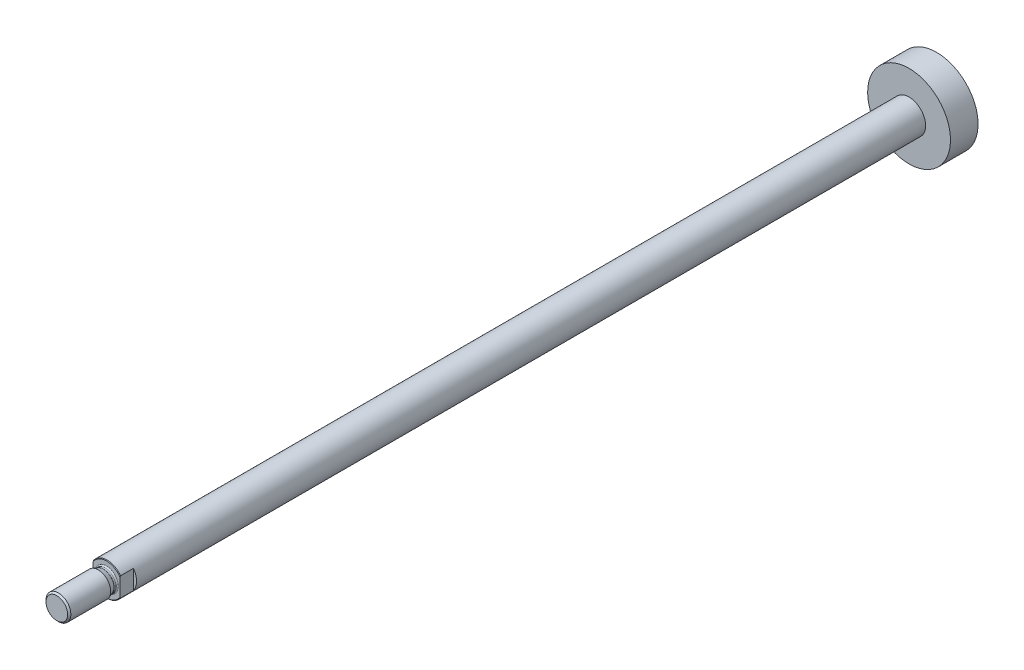
ISO-10303-21;
HEADER;
FILE_DESCRIPTION(('STEP AP214'),'2;1');
FILE_NAME('part.step','',(''),(''),'','','');
FILE_SCHEMA(('AUTOMOTIVE_DESIGN { 1 0 10303 214 1 1 1 1 }'));
ENDSEC;
DATA;
#1=APPLICATION_CONTEXT('core data for automotive mechanical design processes');
#2=APPLICATION_PROTOCOL_DEFINITION('international standard','automotive_design',2000,#1);
#3=PRODUCT_CONTEXT('',#1,'mechanical');
#4=PRODUCT('Part','Part','',(#3));
#5=PRODUCT_RELATED_PRODUCT_CATEGORY('part','',(#4));
#6=PRODUCT_DEFINITION_FORMATION('','',#4);
#7=PRODUCT_DEFINITION_CONTEXT('part definition',#1,'design');
#8=PRODUCT_DEFINITION('design','',#6,#7);
#9=PRODUCT_DEFINITION_SHAPE('','',#8);
#10=(LENGTH_UNIT() NAMED_UNIT(*) SI_UNIT(.MILLI.,.METRE.));
#11=(NAMED_UNIT(*) PLANE_ANGLE_UNIT() SI_UNIT($,.RADIAN.));
#12=(NAMED_UNIT(*) SI_UNIT($,.STERADIAN.) SOLID_ANGLE_UNIT());
#13=UNCERTAINTY_MEASURE_WITH_UNIT(LENGTH_MEASURE(1.E-05),#10,'distance_accuracy_value','');
#14=(GEOMETRIC_REPRESENTATION_CONTEXT(3) GLOBAL_UNCERTAINTY_ASSIGNED_CONTEXT((#13)) GLOBAL_UNIT_ASSIGNED_CONTEXT((#10,
#11,#12)) REPRESENTATION_CONTEXT('',''));
#15=CARTESIAN_POINT('',(0.,0.,0.));
#16=DIRECTION('',(0.,0.,1.));
#17=DIRECTION('',(1.,0.,0.));
#18=AXIS2_PLACEMENT_3D('',#15,#16,#17);
#19=CARTESIAN_POINT('',(-6.5,13.,35.4));
#20=DIRECTION('',(-1.,0.,0.));
#21=DIRECTION('',(0.,0.,1.));
#22=AXIS2_PLACEMENT_3D('',#19,#20,#21);
#23=PLANE('',#22);
#24=DIRECTION('',(0.,0.,-1.));
#25=VECTOR('',#24,1.);
#26=CARTESIAN_POINT('',(-6.5,4.66368952654441,-372.));
#27=LINE('',#26,#25);
#28=CARTESIAN_POINT('',(-6.5,4.66368952654441,28.6171572875253));
#29=VERTEX_POINT('',#28);
#30=CARTESIAN_POINT('',(-6.5,4.66368952654441,22.4));
#31=VERTEX_POINT('',#30);
#32=EDGE_CURVE('E11',#29,#31,#27,.T.);
#33=ORIENTED_EDGE('',*,*,#32,.T.);
#34=DIRECTION('',(0.,-1.,0.));
#35=VECTOR('',#34,1.);
#36=CARTESIAN_POINT('',(-6.5,13.,22.4));
#37=LINE('',#36,#35);
#38=CARTESIAN_POINT('',(-6.5,-4.66368952654441,22.4));
#39=VERTEX_POINT('',#38);
#40=EDGE_CURVE('E27',#31,#39,#37,.T.);
#41=ORIENTED_EDGE('',*,*,#40,.T.);
#42=DIRECTION('',(0.,0.,1.));
#43=VECTOR('',#42,1.);
#44=CARTESIAN_POINT('',(-6.5,-4.66368952654441,-372.));
#45=LINE('',#44,#43);
#46=CARTESIAN_POINT('',(-6.5,-4.66368952654441,28.6171572875254));
#47=VERTEX_POINT('',#46);
#48=EDGE_CURVE('E126',#39,#47,#45,.T.);
#49=ORIENTED_EDGE('',*,*,#48,.T.);
#50=CARTESIAN_POINT('',(-6.5,-4.66368952654439,28.6171572875254));
#51=CARTESIAN_POINT('',(-6.5,-4.4971291913272,28.7142554988866));
#52=CARTESIAN_POINT('',(-6.5,-4.32926417371851,28.8086893545855));
#53=CARTESIAN_POINT('',(-6.5,-4.15986978166458,28.9));
#54=(BOUNDED_CURVE() B_SPLINE_CURVE(3,(#50,#51,#52,#53),.UNSPECIFIED.,.F.,
.F.) B_SPLINE_CURVE_WITH_KNOTS((4,4),(0.0151560519074844,0.0157338284547832),
.UNSPECIFIED.) CURVE() GEOMETRIC_REPRESENTATION_ITEM() RATIONAL_B_SPLINE_CURVE((1.,1.,1.,1.)) REPRESENTATION_ITEM(''));
#55=CARTESIAN_POINT('',(-6.5,-4.15986978166458,28.9));
#56=VERTEX_POINT('',#55);
#57=EDGE_CURVE('E118',#47,#56,#54,.T.);
#58=ORIENTED_EDGE('',*,*,#57,.T.);
#59=DIRECTION('',(0.,1.,0.));
#60=VECTOR('',#59,1.);
#61=CARTESIAN_POINT('',(-6.5,0.,28.9));
#62=LINE('',#61,#60);
#63=CARTESIAN_POINT('',(-6.5,4.15986978166458,28.9));
#64=VERTEX_POINT('',#63);
#65=EDGE_CURVE('E115',#56,#64,#62,.T.);
#66=ORIENTED_EDGE('',*,*,#65,.T.);
#67=CARTESIAN_POINT('',(-6.5,4.15986978166458,28.9));
#68=CARTESIAN_POINT('',(-6.5,4.32944357444657,28.8085926501075));
#69=CARTESIAN_POINT('',(-6.5,4.49729616245943,28.7141581611965));
#70=CARTESIAN_POINT('',(-6.5,4.6636895265444,28.6171572875253));
#71=(BOUNDED_CURVE() B_SPLINE_CURVE(3,(#67,#68,#69,#70),.UNSPECIFIED.,.F.,
.F.) B_SPLINE_CURVE_WITH_KNOTS((4,4),(0.0245061748775562,0.0250901945332971),
.UNSPECIFIED.) CURVE() GEOMETRIC_REPRESENTATION_ITEM() RATIONAL_B_SPLINE_CURVE((1.,1.,1.,1.)) REPRESENTATION_ITEM(''));
#72=EDGE_CURVE('E119',#64,#29,#71,.T.);
#73=ORIENTED_EDGE('',*,*,#72,.T.);
#74=EDGE_LOOP('',(#33,#41,#49,#58,#66,#73));
#75=FACE_BOUND('',#74,.T.);
#76=ADVANCED_FACE('F16',(#75),#23,.T.);
#77=CARTESIAN_POINT('',(6.5,13.,22.4));
#78=DIRECTION('',(1.,0.,0.));
#79=DIRECTION('',(0.,1.,0.));
#80=AXIS2_PLACEMENT_3D('',#77,#78,#79);
#81=PLANE('',#80);
#82=DIRECTION('',(0.,0.,-1.));
#83=VECTOR('',#82,1.);
#84=CARTESIAN_POINT('',(6.5,-4.66368952654441,-372.));
#85=LINE('',#84,#83);
#86=CARTESIAN_POINT('',(6.5,-4.66368952654441,28.6171572875253));
#87=VERTEX_POINT('',#86);
#88=CARTESIAN_POINT('',(6.5,-4.66368952654441,22.4));
#89=VERTEX_POINT('',#88);
#90=EDGE_CURVE('E136',#87,#89,#85,.T.);
#91=ORIENTED_EDGE('',*,*,#90,.T.);
#92=DIRECTION('',(0.,-1.,0.));
#93=VECTOR('',#92,1.);
#94=CARTESIAN_POINT('',(6.5,13.,22.4));
#95=LINE('',#94,#93);
#96=CARTESIAN_POINT('',(6.5,4.66368952654441,22.4));
#97=VERTEX_POINT('',#96);
#98=EDGE_CURVE('E173',#97,#89,#95,.T.);
#99=ORIENTED_EDGE('',*,*,#98,.F.);
#100=DIRECTION('',(0.,0.,1.));
#101=VECTOR('',#100,1.);
#102=CARTESIAN_POINT('',(6.5,4.66368952654441,-372.));
#103=LINE('',#102,#101);
#104=CARTESIAN_POINT('',(6.5,4.66368952654441,28.6171572875254));
#105=VERTEX_POINT('',#104);
#106=EDGE_CURVE('E140',#97,#105,#103,.T.);
#107=ORIENTED_EDGE('',*,*,#106,.T.);
#108=CARTESIAN_POINT('',(6.5,4.66368952654439,28.6171572875254));
#109=CARTESIAN_POINT('',(6.5,4.4971291913272,28.7142554988866));
#110=CARTESIAN_POINT('',(6.5,4.32926417371851,28.8086893545855));
#111=CARTESIAN_POINT('',(6.5,4.15986978166458,28.9));
#112=(BOUNDED_CURVE() B_SPLINE_CURVE(3,(#108,#109,#110,#111),.UNSPECIFIED.,.F.,
.F.) B_SPLINE_CURVE_WITH_KNOTS((4,4),(0.0151560519074844,0.0157338284547832),
.UNSPECIFIED.) CURVE() GEOMETRIC_REPRESENTATION_ITEM() RATIONAL_B_SPLINE_CURVE((1.,1.,1.,1.)) REPRESENTATION_ITEM(''));
#113=CARTESIAN_POINT('',(6.5,4.15986978166458,28.9));
#114=VERTEX_POINT('',#113);
#115=EDGE_CURVE('E141',#105,#114,#112,.T.);
#116=ORIENTED_EDGE('',*,*,#115,.T.);
#117=DIRECTION('',(0.,-1.,0.));
#118=VECTOR('',#117,1.);
#119=CARTESIAN_POINT('',(6.5,0.,28.9));
#120=LINE('',#119,#118);
#121=CARTESIAN_POINT('',(6.5,-4.15986978166458,28.9));
#122=VERTEX_POINT('',#121);
#123=EDGE_CURVE('E147',#114,#122,#120,.T.);
#124=ORIENTED_EDGE('',*,*,#123,.T.);
#125=CARTESIAN_POINT('',(6.5,-4.15986978166457,28.9));
#126=CARTESIAN_POINT('',(6.5,-4.32944357444657,28.8085926501075));
#127=CARTESIAN_POINT('',(6.5,-4.49729616245943,28.7141581611965));
#128=CARTESIAN_POINT('',(6.5,-4.66368952654441,28.6171572875253));
#129=(BOUNDED_CURVE() B_SPLINE_CURVE(3,(#125,#126,#127,#128),.UNSPECIFIED.,.F.,
.F.) B_SPLINE_CURVE_WITH_KNOTS((4,4),(0.0245061748775562,0.0250901945332971),
.UNSPECIFIED.) CURVE() GEOMETRIC_REPRESENTATION_ITEM() RATIONAL_B_SPLINE_CURVE((1.,1.,1.,1.)) REPRESENTATION_ITEM(''));
#130=EDGE_CURVE('E168',#122,#87,#129,.T.);
#131=ORIENTED_EDGE('',*,*,#130,.T.);
#132=EDGE_LOOP('',(#91,#99,#107,#116,#124,#131));
#133=FACE_BOUND('',#132,.T.);
#134=ADVANCED_FACE('F226',(#133),#81,.T.);
#135=CARTESIAN_POINT('',(13.,13.,22.4));
#136=DIRECTION('',(0.,0.,1.));
#137=DIRECTION('',(1.,0.,0.));
#138=AXIS2_PLACEMENT_3D('',#135,#136,#137);
#139=PLANE('',#138);
#140=CARTESIAN_POINT('',(0.,0.,22.4));
#141=DIRECTION('',(0.,0.,1.));
#142=DIRECTION('',(1.,0.,0.));
#143=AXIS2_PLACEMENT_3D('',#140,#141,#142);
#144=CIRCLE('',#143,8.);
#145=EDGE_CURVE('E20',#89,#97,#144,.T.);
#146=ORIENTED_EDGE('',*,*,#145,.T.);
#147=ORIENTED_EDGE('',*,*,#98,.T.);
#148=EDGE_LOOP('',(#146,#147));
#149=FACE_BOUND('',#148,.T.);
#150=ADVANCED_FACE('F230',(#149),#139,.T.);
#151=CARTESIAN_POINT('',(0.,20.,-372.));
#152=DIRECTION('',(0.,0.,1.));
#153=DIRECTION('',(1.,0.,0.));
#154=AXIS2_PLACEMENT_3D('',#151,#152,#153);
#155=PLANE('',#154);
#156=CARTESIAN_POINT('',(0.,0.,-372.));
#157=DIRECTION('',(0.,0.,-1.));
#158=DIRECTION('',(-1.,0.,0.));
#159=AXIS2_PLACEMENT_3D('',#156,#157,#158);
#160=CIRCLE('',#159,20.);
#161=CARTESIAN_POINT('',(-20.,0.,-372.));
#162=VERTEX_POINT('',#161);
#163=EDGE_CURVE('E133',#162,#162,#160,.T.);
#164=ORIENTED_EDGE('',*,*,#163,.T.);
#165=EDGE_LOOP('',(#164));
#166=FACE_BOUND('',#165,.T.);
#167=ADVANCED_FACE('F232',(#166),#155,.F.);
#168=CARTESIAN_POINT('',(0.,0.,-372.));
#169=DIRECTION('',(0.,0.,1.));
#170=DIRECTION('',(-1.,0.,0.));
#171=AXIS2_PLACEMENT_3D('',#168,#169,#170);
#172=CYLINDRICAL_SURFACE('',#171,20.);
#173=CARTESIAN_POINT('',(0.,0.,-358.666666666667));
#174=DIRECTION('',(0.,0.,-1.));
#175=DIRECTION('',(-1.,0.,0.));
#176=AXIS2_PLACEMENT_3D('',#173,#174,#175);
#177=CIRCLE('',#176,20.);
#178=CARTESIAN_POINT('',(-20.,0.,-358.666666666667));
#179=VERTEX_POINT('',#178);
#180=EDGE_CURVE('E112',#179,#179,#177,.T.);
#181=ORIENTED_EDGE('',*,*,#180,.T.);
#182=EDGE_LOOP('',(#181));
#183=FACE_BOUND('',#182,.T.);
#184=ORIENTED_EDGE('',*,*,#163,.F.);
#185=EDGE_LOOP('',(#184));
#186=FACE_BOUND('',#185,.T.);
#187=ADVANCED_FACE('F239',(#183,#186),#172,.T.);
#188=CARTESIAN_POINT('',(0.,8.,-358.666666666667));
#189=DIRECTION('',(0.,0.,-1.));
#190=DIRECTION('',(0.,-1.,0.));
#191=AXIS2_PLACEMENT_3D('',#188,#189,#190);
#192=PLANE('',#191);
#193=ORIENTED_EDGE('',*,*,#180,.F.);
#194=EDGE_LOOP('',(#193));
#195=FACE_BOUND('',#194,.T.);
#196=CARTESIAN_POINT('',(0.,0.,-358.666666666667));
#197=DIRECTION('',(0.,0.,-1.));
#198=DIRECTION('',(-1.,0.,0.));
#199=AXIS2_PLACEMENT_3D('',#196,#197,#198);
#200=CIRCLE('',#199,8.);
#201=CARTESIAN_POINT('',(-8.,0.,-358.666666666667));
#202=VERTEX_POINT('',#201);
#203=EDGE_CURVE('E109',#202,#202,#200,.T.);
#204=ORIENTED_EDGE('',*,*,#203,.T.);
#205=EDGE_LOOP('',(#204));
#206=FACE_BOUND('',#205,.T.);
#207=ADVANCED_FACE('F249',(#195,#206),#192,.F.);
#208=CARTESIAN_POINT('',(0.,0.,-372.));
#209=DIRECTION('',(0.,0.,1.));
#210=DIRECTION('',(-1.,0.,0.));
#211=AXIS2_PLACEMENT_3D('',#208,#209,#210);
#212=CYLINDRICAL_SURFACE('',#211,8.);
#213=ORIENTED_EDGE('',*,*,#90,.F.);
#214=CARTESIAN_POINT('',(0.,0.,28.6171572875253));
#215=DIRECTION('',(0.,0.,-1.));
#216=DIRECTION('',(-1.,0.,0.));
#217=AXIS2_PLACEMENT_3D('',#214,#215,#216);
#218=CIRCLE('',#217,8.);
#219=EDGE_CURVE('E113',#87,#47,#218,.T.);
#220=ORIENTED_EDGE('',*,*,#219,.T.);
#221=ORIENTED_EDGE('',*,*,#48,.F.);
#222=CARTESIAN_POINT('',(0.,0.,22.4));
#223=DIRECTION('',(0.,0.,1.));
#224=DIRECTION('',(1.,0.,0.));
#225=AXIS2_PLACEMENT_3D('',#222,#223,#224);
#226=CIRCLE('',#225,8.);
#227=EDGE_CURVE('E100',#31,#39,#226,.T.);
#228=ORIENTED_EDGE('',*,*,#227,.F.);
#229=ORIENTED_EDGE('',*,*,#32,.F.);
#230=CARTESIAN_POINT('',(0.,0.,28.6171572875253));
#231=DIRECTION('',(0.,0.,-1.));
#232=DIRECTION('',(-1.,0.,0.));
#233=AXIS2_PLACEMENT_3D('',#230,#231,#232);
#234=CIRCLE('',#233,8.);
#235=EDGE_CURVE('E105',#29,#105,#234,.T.);
#236=ORIENTED_EDGE('',*,*,#235,.T.);
#237=ORIENTED_EDGE('',*,*,#106,.F.);
#238=ORIENTED_EDGE('',*,*,#145,.F.);
#239=EDGE_LOOP('',(#213,#220,#221,#228,#229,#236,#237,#238));
#240=FACE_BOUND('',#239,.T.);
#241=ORIENTED_EDGE('',*,*,#203,.F.);
#242=EDGE_LOOP('',(#241));
#243=FACE_BOUND('',#242,.T.);
#244=ADVANCED_FACE('F219',(#240,#243),#212,.T.);
#245=CARTESIAN_POINT('',(0.,0.,28.9));
#246=DIRECTION('',(0.,0.,-1.));
#247=DIRECTION('',(-1.,0.,0.));
#248=AXIS2_PLACEMENT_3D('',#245,#246,#247);
#249=CONICAL_SURFACE('',#248,7.71715728752538,0.785398163397412);
#250=ORIENTED_EDGE('',*,*,#72,.F.);
#251=CARTESIAN_POINT('',(0.,0.,28.9));
#252=DIRECTION('',(0.,0.,-1.));
#253=DIRECTION('',(-1.,0.,0.));
#254=AXIS2_PLACEMENT_3D('',#251,#252,#253);
#255=CIRCLE('',#254,7.71715728752538);
#256=EDGE_CURVE('E101',#64,#114,#255,.T.);
#257=ORIENTED_EDGE('',*,*,#256,.T.);
#258=ORIENTED_EDGE('',*,*,#115,.F.);
#259=ORIENTED_EDGE('',*,*,#235,.F.);
#260=EDGE_LOOP('',(#250,#257,#258,#259));
#261=FACE_BOUND('',#260,.T.);
#262=ADVANCED_FACE('F223',(#261),#249,.T.);
#263=CARTESIAN_POINT('',(0.,0.,28.9));
#264=DIRECTION('',(0.,0.,-1.));
#265=DIRECTION('',(0.,-1.,0.));
#266=AXIS2_PLACEMENT_3D('',#263,#264,#265);
#267=PLANE('',#266);
#268=ORIENTED_EDGE('',*,*,#256,.F.);
#269=ORIENTED_EDGE('',*,*,#65,.F.);
#270=CARTESIAN_POINT('',(0.,0.,28.9));
#271=DIRECTION('',(0.,0.,-1.));
#272=DIRECTION('',(-1.,0.,0.));
#273=AXIS2_PLACEMENT_3D('',#270,#271,#272);
#274=CIRCLE('',#273,7.71715728752538);
#275=EDGE_CURVE('E96',#122,#56,#274,.T.);
#276=ORIENTED_EDGE('',*,*,#275,.F.);
#277=ORIENTED_EDGE('',*,*,#123,.F.);
#278=EDGE_LOOP('',(#268,#269,#276,#277));
#279=FACE_BOUND('',#278,.T.);
#280=CARTESIAN_POINT('',(0.,0.,28.9));
#281=DIRECTION('',(0.,0.,-1.));
#282=DIRECTION('',(-1.,0.,0.));
#283=AXIS2_PLACEMENT_3D('',#280,#281,#282);
#284=CIRCLE('',#283,5.7);
#285=CARTESIAN_POINT('',(-5.7,0.,28.9));
#286=VERTEX_POINT('',#285);
#287=EDGE_CURVE('E99',#286,#286,#284,.T.);
#288=ORIENTED_EDGE('',*,*,#287,.T.);
#289=EDGE_LOOP('',(#288));
#290=FACE_BOUND('',#289,.T.);
#291=ADVANCED_FACE('F259',(#279,#290),#267,.F.);
#292=CARTESIAN_POINT('',(0.,0.,28.9));
#293=DIRECTION('',(0.,0.,-1.));
#294=DIRECTION('',(-1.,0.,0.));
#295=AXIS2_PLACEMENT_3D('',#292,#293,#294);
#296=CONICAL_SURFACE('',#295,7.71715728752538,0.785398163397412);
#297=ORIENTED_EDGE('',*,*,#130,.F.);
#298=ORIENTED_EDGE('',*,*,#275,.T.);
#299=ORIENTED_EDGE('',*,*,#57,.F.);
#300=ORIENTED_EDGE('',*,*,#219,.F.);
#301=EDGE_LOOP('',(#297,#298,#299,#300));
#302=FACE_BOUND('',#301,.T.);
#303=ADVANCED_FACE('F262',(#302),#296,.T.);
#304=CARTESIAN_POINT('',(-6.5,13.,22.4));
#305=DIRECTION('',(0.,0.,1.));
#306=DIRECTION('',(1.,0.,0.));
#307=AXIS2_PLACEMENT_3D('',#304,#305,#306);
#308=PLANE('',#307);
#309=ORIENTED_EDGE('',*,*,#227,.T.);
#310=ORIENTED_EDGE('',*,*,#40,.F.);
#311=EDGE_LOOP('',(#309,#310));
#312=FACE_BOUND('',#311,.T.);
#313=ADVANCED_FACE('F257',(#312),#308,.T.);
#314=CARTESIAN_POINT('',(0.,0.,52.9));
#315=DIRECTION('',(0.,0.,-1.));
#316=DIRECTION('',(0.,-1.,0.));
#317=AXIS2_PLACEMENT_3D('',#314,#315,#316);
#318=PLANE('',#317);
#319=CARTESIAN_POINT('',(0.,0.,52.9));
#320=DIRECTION('',(0.,0.,-1.));
#321=DIRECTION('',(-1.,0.,0.));
#322=AXIS2_PLACEMENT_3D('',#319,#320,#321);
#323=CIRCLE('',#322,5.233);
#324=CARTESIAN_POINT('',(-5.233,0.,52.9));
#325=VERTEX_POINT('',#324);
#326=EDGE_CURVE('E86',#325,#325,#323,.T.);
#327=ORIENTED_EDGE('',*,*,#326,.F.);
#328=EDGE_LOOP('',(#327));
#329=FACE_BOUND('',#328,.T.);
#330=ADVANCED_FACE('F253',(#329),#318,.F.);
#331=CARTESIAN_POINT('',(0.,0.,52.9));
#332=DIRECTION('',(0.,0.,-1.));
#333=DIRECTION('',(-1.,0.,0.));
#334=AXIS2_PLACEMENT_3D('',#331,#332,#333);
#335=CONICAL_SURFACE('',#334,5.233,0.785398163397446);
#336=CARTESIAN_POINT('',(0.,0.,52.133));
#337=DIRECTION('',(0.,0.,-1.));
#338=DIRECTION('',(-1.,0.,0.));
#339=AXIS2_PLACEMENT_3D('',#336,#337,#338);
#340=CIRCLE('',#339,6.);
#341=CARTESIAN_POINT('',(-6.,0.,52.133));
#342=VERTEX_POINT('',#341);
#343=EDGE_CURVE('E78',#342,#342,#340,.T.);
#344=ORIENTED_EDGE('',*,*,#343,.F.);
#345=EDGE_LOOP('',(#344));
#346=FACE_BOUND('',#345,.T.);
#347=ORIENTED_EDGE('',*,*,#326,.T.);
#348=EDGE_LOOP('',(#347));
#349=FACE_BOUND('',#348,.T.);
#350=ADVANCED_FACE('F256',(#346,#349),#335,.T.);
#351=CARTESIAN_POINT('',(0.,0.,28.3));
#352=DIRECTION('',(0.,0.,1.));
#353=DIRECTION('',(-1.,0.,0.));
#354=AXIS2_PLACEMENT_3D('',#351,#352,#353);
#355=CYLINDRICAL_SURFACE('',#354,6.);
#356=ORIENTED_EDGE('',*,*,#343,.T.);
#357=EDGE_LOOP('',(#356));
#358=FACE_BOUND('',#357,.T.);
#359=CARTESIAN_POINT('',(0.,0.,32.8727296775092));
#360=DIRECTION('',(0.,0.,-1.));
#361=DIRECTION('',(-1.,0.,0.));
#362=AXIS2_PLACEMENT_3D('',#359,#360,#361);
#363=CIRCLE('',#362,6.);
#364=CARTESIAN_POINT('',(-6.,0.,32.8727296775092));
#365=VERTEX_POINT('',#364);
#366=EDGE_CURVE('E74',#365,#365,#363,.T.);
#367=ORIENTED_EDGE('',*,*,#366,.F.);
#368=EDGE_LOOP('',(#367));
#369=FACE_BOUND('',#368,.T.);
#370=ADVANCED_FACE('F75',(#358,#369),#355,.T.);
#371=CARTESIAN_POINT('',(0.,0.,32.8727296775092));
#372=DIRECTION('',(0.,0.,1.));
#373=DIRECTION('',(1.,0.,0.));
#374=AXIS2_PLACEMENT_3D('',#371,#372,#373);
#375=CONICAL_SURFACE('',#374,6.,0.349065850398865);
#376=ORIENTED_EDGE('',*,*,#366,.T.);
#377=EDGE_LOOP('',(#376));
#378=FACE_BOUND('',#377,.T.);
#379=CARTESIAN_POINT('',(0.,0.,30.4994158975703));
#380=DIRECTION('',(0.,0.,-1.));
#381=DIRECTION('',(-1.,0.,0.));
#382=AXIS2_PLACEMENT_3D('',#379,#380,#381);
#383=CIRCLE('',#382,5.13618442752845);
#384=CARTESIAN_POINT('',(-5.13618442752845,0.,30.4994158975703));
#385=VERTEX_POINT('',#384);
#386=EDGE_CURVE('E79',#385,#385,#383,.T.);
#387=ORIENTED_EDGE('',*,*,#386,.F.);
#388=EDGE_LOOP('',(#387));
#389=FACE_BOUND('',#388,.T.);
#390=ADVANCED_FACE('F268',(#378,#389),#375,.T.);
#391=CARTESIAN_POINT('',(0.,0.,30.2942038115749));
#392=DIRECTION('',(0.,0.,-1.));
#393=DIRECTION('',(-1.,0.,0.));
#394=AXIS2_PLACEMENT_3D('',#391,#392,#393);
#395=TOROIDAL_SURFACE('',#394,5.7,0.600000000000016);
#396=ORIENTED_EDGE('',*,*,#386,.T.);
#397=EDGE_LOOP('',(#396));
#398=FACE_BOUND('',#397,.T.);
#399=CARTESIAN_POINT('',(0.,0.,30.2942038115749));
#400=DIRECTION('',(0.,0.,-1.));
#401=DIRECTION('',(-1.,0.,0.));
#402=AXIS2_PLACEMENT_3D('',#399,#400,#401);
#403=CIRCLE('',#402,5.1);
#404=CARTESIAN_POINT('',(-5.1,0.,30.2942038115749));
#405=VERTEX_POINT('',#404);
#406=EDGE_CURVE('E90',#405,#405,#403,.T.);
#407=ORIENTED_EDGE('',*,*,#406,.F.);
#408=EDGE_LOOP('',(#407));
#409=FACE_BOUND('',#408,.T.);
#410=ADVANCED_FACE('F271',(#398,#409),#395,.F.);
#411=CARTESIAN_POINT('',(0.,0.,28.3));
#412=DIRECTION('',(0.,0.,1.));
#413=DIRECTION('',(-1.,0.,0.));
#414=AXIS2_PLACEMENT_3D('',#411,#412,#413);
#415=CYLINDRICAL_SURFACE('',#414,5.1);
#416=ORIENTED_EDGE('',*,*,#406,.T.);
#417=EDGE_LOOP('',(#416));
#418=FACE_BOUND('',#417,.T.);
#419=CARTESIAN_POINT('',(0.,0.,29.5));
#420=DIRECTION('',(0.,0.,-1.));
#421=DIRECTION('',(-1.,0.,0.));
#422=AXIS2_PLACEMENT_3D('',#419,#420,#421);
#423=CIRCLE('',#422,5.1);
#424=CARTESIAN_POINT('',(-5.1,0.,29.5));
#425=VERTEX_POINT('',#424);
#426=EDGE_CURVE('E94',#425,#425,#423,.T.);
#427=ORIENTED_EDGE('',*,*,#426,.F.);
#428=EDGE_LOOP('',(#427));
#429=FACE_BOUND('',#428,.T.);
#430=ADVANCED_FACE('F18',(#418,#429),#415,.T.);
#431=CARTESIAN_POINT('',(0.,0.,29.5));
#432=DIRECTION('',(0.,0.,-1.));
#433=DIRECTION('',(-1.,0.,0.));
#434=AXIS2_PLACEMENT_3D('',#431,#432,#433);
#435=TOROIDAL_SURFACE('',#434,5.7,0.6);
#436=ORIENTED_EDGE('',*,*,#426,.T.);
#437=EDGE_LOOP('',(#436));
#438=FACE_BOUND('',#437,.T.);
#439=ORIENTED_EDGE('',*,*,#287,.F.);
#440=EDGE_LOOP('',(#439));
#441=FACE_BOUND('',#440,.T.);
#442=ADVANCED_FACE('F272',(#438,#441),#435,.F.);
#443=CLOSED_SHELL('',(#76,#134,#150,#167,#187,#207,#244,#262,#291,#303,#313,#330,#350,#370,#390,
#410,#430,#442));
#444=MANIFOLD_SOLID_BREP('B1',#443);
#445=ADVANCED_BREP_SHAPE_REPRESENTATION('',(#18,#444),#14);
#446=SHAPE_DEFINITION_REPRESENTATION(#9,#445);
ENDSEC;
END-ISO-10303-21;
